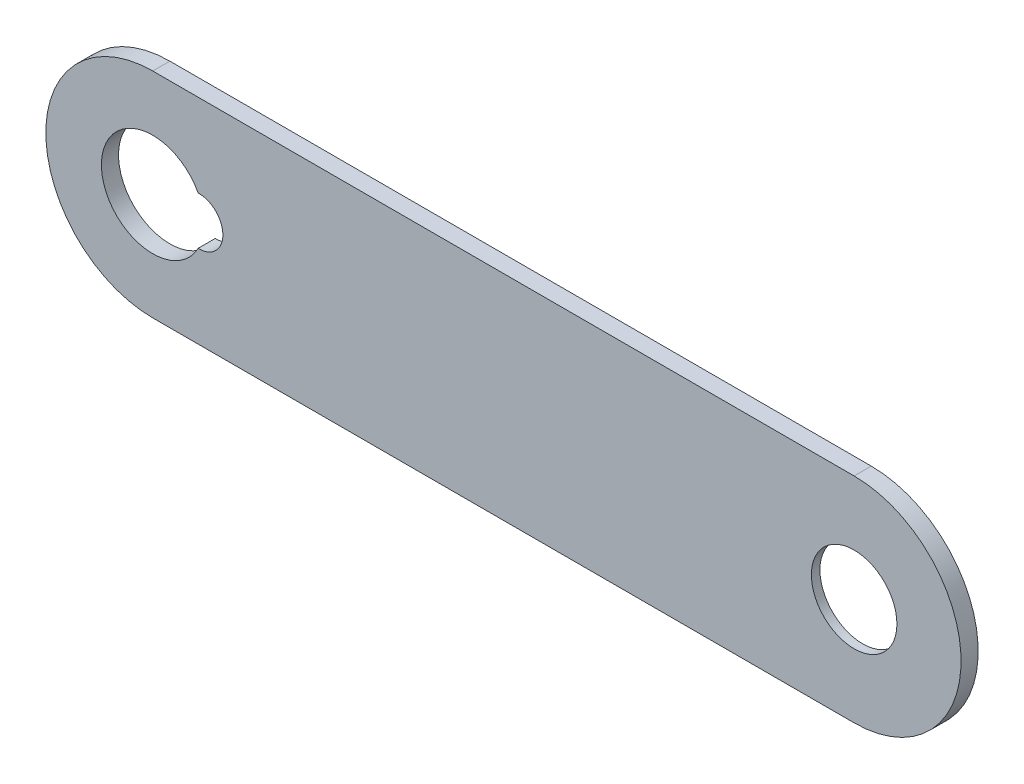
ISO-10303-21;
HEADER;
FILE_DESCRIPTION(('STEP AP214'),'2;1');
FILE_NAME('part.step','',(''),(''),'','','');
FILE_SCHEMA(('AUTOMOTIVE_DESIGN { 1 0 10303 214 1 1 1 1 }'));
ENDSEC;
DATA;
#1=APPLICATION_CONTEXT('core data for automotive mechanical design processes');
#2=APPLICATION_PROTOCOL_DEFINITION('international standard','automotive_design',2000,#1);
#3=PRODUCT_CONTEXT('',#1,'mechanical');
#4=PRODUCT('Part','Part','',(#3));
#5=PRODUCT_RELATED_PRODUCT_CATEGORY('part','',(#4));
#6=PRODUCT_DEFINITION_FORMATION('','',#4);
#7=PRODUCT_DEFINITION_CONTEXT('part definition',#1,'design');
#8=PRODUCT_DEFINITION('design','',#6,#7);
#9=PRODUCT_DEFINITION_SHAPE('','',#8);
#10=(LENGTH_UNIT() NAMED_UNIT(*) SI_UNIT(.MILLI.,.METRE.));
#11=(NAMED_UNIT(*) PLANE_ANGLE_UNIT() SI_UNIT($,.RADIAN.));
#12=(NAMED_UNIT(*) SI_UNIT($,.STERADIAN.) SOLID_ANGLE_UNIT());
#13=UNCERTAINTY_MEASURE_WITH_UNIT(LENGTH_MEASURE(1.E-05),#10,'distance_accuracy_value','');
#14=(GEOMETRIC_REPRESENTATION_CONTEXT(3) GLOBAL_UNCERTAINTY_ASSIGNED_CONTEXT((#13)) GLOBAL_UNIT_ASSIGNED_CONTEXT((#10,
#11,#12)) REPRESENTATION_CONTEXT('',''));
#15=CARTESIAN_POINT('',(0.,0.,0.));
#16=DIRECTION('',(0.,0.,1.));
#17=DIRECTION('',(1.,0.,0.));
#18=AXIS2_PLACEMENT_3D('',#15,#16,#17);
#19=CARTESIAN_POINT('',(32.5,8.60239852398525,2.));
#20=DIRECTION('',(0.,0.,1.));
#21=DIRECTION('',(1.,0.,0.));
#22=AXIS2_PLACEMENT_3D('',#19,#20,#21);
#23=PLANE('',#22);
#24=CARTESIAN_POINT('',(32.5,8.60239852398525,2.));
#25=DIRECTION('',(0.,0.,1.));
#26=DIRECTION('',(1.,0.,0.));
#27=AXIS2_PLACEMENT_3D('',#24,#25,#26);
#28=CIRCLE('',#27,5.);
#29=CARTESIAN_POINT('',(37.5,8.60239852398525,2.));
#30=VERTEX_POINT('',#29);
#31=EDGE_CURVE('E163',#30,#30,#28,.T.);
#32=ORIENTED_EDGE('',*,*,#31,.F.);
#33=EDGE_LOOP('',(#32));
#34=FACE_BOUND('',#33,.T.);
#35=CARTESIAN_POINT('',(-49.5,8.60239852398525,2.));
#36=DIRECTION('',(0.,0.,-1.));
#37=DIRECTION('',(-1.,0.,0.));
#38=AXIS2_PLACEMENT_3D('',#35,#36,#37);
#39=CIRCLE('',#38,6.);
#40=CARTESIAN_POINT('',(-44.1925925925926,5.80392990493715,2.));
#41=VERTEX_POINT('',#40);
#42=CARTESIAN_POINT('',(-44.1925925925926,11.4008671430333,2.));
#43=VERTEX_POINT('',#42);
#44=EDGE_CURVE('E78',#41,#43,#39,.T.);
#45=ORIENTED_EDGE('',*,*,#44,.T.);
#46=CARTESIAN_POINT('',(-44.1,8.60239852398525,2.));
#47=DIRECTION('',(0.,0.,-1.));
#48=DIRECTION('',(-1.,0.,0.));
#49=AXIS2_PLACEMENT_3D('',#46,#47,#48);
#50=CIRCLE('',#49,2.8);
#51=EDGE_CURVE('E211',#43,#41,#50,.T.);
#52=ORIENTED_EDGE('',*,*,#51,.T.);
#53=EDGE_LOOP('',(#45,#52));
#54=FACE_BOUND('',#53,.T.);
#55=CARTESIAN_POINT('',(32.5,8.60239852398525,2.));
#56=DIRECTION('',(0.,0.,1.));
#57=DIRECTION('',(1.,0.,0.));
#58=AXIS2_PLACEMENT_3D('',#55,#56,#57);
#59=CIRCLE('',#58,12.5);
#60=CARTESIAN_POINT('',(32.4999999999997,-3.89760147601474,2.));
#61=VERTEX_POINT('',#60);
#62=CARTESIAN_POINT('',(32.5,21.1023985239852,2.));
#63=VERTEX_POINT('',#62);
#64=EDGE_CURVE('E229',#61,#63,#59,.T.);
#65=ORIENTED_EDGE('',*,*,#64,.T.);
#66=DIRECTION('',(-1.,0.,0.));
#67=VECTOR('',#66,1.);
#68=CARTESIAN_POINT('',(-49.5,21.1023985239852,2.));
#69=LINE('',#68,#67);
#70=CARTESIAN_POINT('',(-49.5,21.1023985239852,2.));
#71=VERTEX_POINT('',#70);
#72=EDGE_CURVE('E232',#63,#71,#69,.T.);
#73=ORIENTED_EDGE('',*,*,#72,.T.);
#74=CARTESIAN_POINT('',(-49.5,8.60239852398525,2.));
#75=DIRECTION('',(0.,0.,1.));
#76=DIRECTION('',(-1.,0.,0.));
#77=AXIS2_PLACEMENT_3D('',#74,#75,#76);
#78=CIRCLE('',#77,12.5);
#79=CARTESIAN_POINT('',(-49.5,-3.89760147601474,2.));
#80=VERTEX_POINT('',#79);
#81=EDGE_CURVE('E236',#71,#80,#78,.T.);
#82=ORIENTED_EDGE('',*,*,#81,.T.);
#83=DIRECTION('',(1.,0.,0.));
#84=VECTOR('',#83,1.);
#85=CARTESIAN_POINT('',(32.4999999999997,-3.89760147601474,2.));
#86=LINE('',#85,#84);
#87=EDGE_CURVE('E178',#80,#61,#86,.T.);
#88=ORIENTED_EDGE('',*,*,#87,.T.);
#89=EDGE_LOOP('',(#65,#73,#82,#88));
#90=FACE_BOUND('',#89,.T.);
#91=ADVANCED_FACE('F52',(#34,#54,#90),#23,.T.);
#92=CARTESIAN_POINT('',(32.5,8.60239852398525,0.));
#93=DIRECTION('',(0.,0.,1.));
#94=DIRECTION('',(1.,0.,0.));
#95=AXIS2_PLACEMENT_3D('',#92,#93,#94);
#96=PLANE('',#95);
#97=DIRECTION('',(0.,1.,0.));
#98=VECTOR('',#97,1.);
#99=CARTESIAN_POINT('',(15.7,0.,0.));
#100=LINE('',#99,#98);
#101=CARTESIAN_POINT('',(15.7,2.40239852398525,0.));
#102=VERTEX_POINT('',#101);
#103=CARTESIAN_POINT('',(15.7,14.8023985239853,0.));
#104=VERTEX_POINT('',#103);
#105=EDGE_CURVE('E190',#102,#104,#100,.T.);
#106=ORIENTED_EDGE('',*,*,#105,.F.);
#107=DIRECTION('',(-1.,0.,0.));
#108=VECTOR('',#107,1.);
#109=CARTESIAN_POINT('',(0.,2.40239852398525,0.));
#110=LINE('',#109,#108);
#111=CARTESIAN_POINT('',(38.5,2.40239852398525,0.));
#112=VERTEX_POINT('',#111);
#113=EDGE_CURVE('E70',#112,#102,#110,.T.);
#114=ORIENTED_EDGE('',*,*,#113,.F.);
#115=DIRECTION('',(0.,-1.,0.));
#116=VECTOR('',#115,1.);
#117=CARTESIAN_POINT('',(38.5,0.,0.));
#118=LINE('',#117,#116);
#119=CARTESIAN_POINT('',(38.5,14.8023985239853,0.));
#120=VERTEX_POINT('',#119);
#121=EDGE_CURVE('E155',#120,#112,#118,.T.);
#122=ORIENTED_EDGE('',*,*,#121,.F.);
#123=DIRECTION('',(1.,0.,0.));
#124=VECTOR('',#123,1.);
#125=CARTESIAN_POINT('',(0.,14.8023985239853,0.));
#126=LINE('',#125,#124);
#127=EDGE_CURVE('E159',#104,#120,#126,.T.);
#128=ORIENTED_EDGE('',*,*,#127,.F.);
#129=EDGE_LOOP('',(#106,#114,#122,#128));
#130=FACE_BOUND('',#129,.T.);
#131=CARTESIAN_POINT('',(-44.1,8.60239852398525,0.));
#132=DIRECTION('',(0.,0.,-1.));
#133=DIRECTION('',(-1.,0.,0.));
#134=AXIS2_PLACEMENT_3D('',#131,#132,#133);
#135=CIRCLE('',#134,2.8);
#136=CARTESIAN_POINT('',(-44.1925925925926,11.4008671430333,0.));
#137=VERTEX_POINT('',#136);
#138=CARTESIAN_POINT('',(-44.1925925925926,5.80392990493715,0.));
#139=VERTEX_POINT('',#138);
#140=EDGE_CURVE('E212',#137,#139,#135,.T.);
#141=ORIENTED_EDGE('',*,*,#140,.F.);
#142=CARTESIAN_POINT('',(-49.5,8.60239852398525,0.));
#143=DIRECTION('',(0.,0.,-1.));
#144=DIRECTION('',(-1.,0.,0.));
#145=AXIS2_PLACEMENT_3D('',#142,#143,#144);
#146=CIRCLE('',#145,6.);
#147=EDGE_CURVE('E202',#139,#137,#146,.T.);
#148=ORIENTED_EDGE('',*,*,#147,.F.);
#149=EDGE_LOOP('',(#141,#148));
#150=FACE_BOUND('',#149,.T.);
#151=CARTESIAN_POINT('',(32.5,8.60239852398525,0.));
#152=DIRECTION('',(0.,0.,1.));
#153=DIRECTION('',(1.,0.,0.));
#154=AXIS2_PLACEMENT_3D('',#151,#152,#153);
#155=CIRCLE('',#154,12.5);
#156=CARTESIAN_POINT('',(32.4999999999997,-3.89760147601474,0.));
#157=VERTEX_POINT('',#156);
#158=CARTESIAN_POINT('',(32.5,21.1023985239852,0.));
#159=VERTEX_POINT('',#158);
#160=EDGE_CURVE('E170',#157,#159,#155,.T.);
#161=ORIENTED_EDGE('',*,*,#160,.F.);
#162=DIRECTION('',(1.,0.,0.));
#163=VECTOR('',#162,1.);
#164=CARTESIAN_POINT('',(32.4999999999997,-3.89760147601474,0.));
#165=LINE('',#164,#163);
#166=CARTESIAN_POINT('',(-49.5,-3.89760147601474,0.));
#167=VERTEX_POINT('',#166);
#168=EDGE_CURVE('E233',#167,#157,#165,.T.);
#169=ORIENTED_EDGE('',*,*,#168,.F.);
#170=CARTESIAN_POINT('',(-49.5,8.60239852398525,0.));
#171=DIRECTION('',(0.,0.,1.));
#172=DIRECTION('',(-1.,0.,0.));
#173=AXIS2_PLACEMENT_3D('',#170,#171,#172);
#174=CIRCLE('',#173,12.5);
#175=CARTESIAN_POINT('',(-49.5,21.1023985239852,0.));
#176=VERTEX_POINT('',#175);
#177=EDGE_CURVE('E183',#176,#167,#174,.T.);
#178=ORIENTED_EDGE('',*,*,#177,.F.);
#179=DIRECTION('',(-1.,0.,0.));
#180=VECTOR('',#179,1.);
#181=CARTESIAN_POINT('',(-49.5,21.1023985239852,0.));
#182=LINE('',#181,#180);
#183=EDGE_CURVE('E176',#159,#176,#182,.T.);
#184=ORIENTED_EDGE('',*,*,#183,.F.);
#185=EDGE_LOOP('',(#161,#169,#178,#184));
#186=FACE_BOUND('',#185,.T.);
#187=ADVANCED_FACE('F266',(#130,#150,#186),#96,.F.);
#188=CARTESIAN_POINT('',(32.5,8.60239852398525,2.));
#189=DIRECTION('',(0.,0.,-1.));
#190=DIRECTION('',(-1.,0.,0.));
#191=AXIS2_PLACEMENT_3D('',#188,#189,#190);
#192=CYLINDRICAL_SURFACE('',#191,12.5);
#193=ORIENTED_EDGE('',*,*,#160,.T.);
#194=DIRECTION('',(0.,0.,-1.));
#195=VECTOR('',#194,1.);
#196=CARTESIAN_POINT('',(32.5,21.1023985239852,2.));
#197=LINE('',#196,#195);
#198=EDGE_CURVE('E12',#63,#159,#197,.T.);
#199=ORIENTED_EDGE('',*,*,#198,.F.);
#200=ORIENTED_EDGE('',*,*,#64,.F.);
#201=DIRECTION('',(0.,0.,-1.));
#202=VECTOR('',#201,1.);
#203=CARTESIAN_POINT('',(32.4999999999997,-3.89760147601474,2.));
#204=LINE('',#203,#202);
#205=EDGE_CURVE('E242',#61,#157,#204,.T.);
#206=ORIENTED_EDGE('',*,*,#205,.T.);
#207=EDGE_LOOP('',(#193,#199,#200,#206));
#208=FACE_BOUND('',#207,.T.);
#209=ADVANCED_FACE('F54',(#208),#192,.T.);
#210=CARTESIAN_POINT('',(-49.5,21.1023985239852,2.));
#211=DIRECTION('',(0.,-1.,0.));
#212=DIRECTION('',(0.,0.,-1.));
#213=AXIS2_PLACEMENT_3D('',#210,#211,#212);
#214=PLANE('',#213);
#215=ORIENTED_EDGE('',*,*,#183,.T.);
#216=DIRECTION('',(0.,0.,-1.));
#217=VECTOR('',#216,1.);
#218=CARTESIAN_POINT('',(-49.5,21.1023985239852,2.));
#219=LINE('',#218,#217);
#220=EDGE_CURVE('E63',#71,#176,#219,.T.);
#221=ORIENTED_EDGE('',*,*,#220,.F.);
#222=ORIENTED_EDGE('',*,*,#72,.F.);
#223=ORIENTED_EDGE('',*,*,#198,.T.);
#224=EDGE_LOOP('',(#215,#221,#222,#223));
#225=FACE_BOUND('',#224,.T.);
#226=ADVANCED_FACE('F272',(#225),#214,.F.);
#227=CARTESIAN_POINT('',(-49.5,8.60239852398525,2.));
#228=DIRECTION('',(0.,0.,-1.));
#229=DIRECTION('',(-1.,0.,0.));
#230=AXIS2_PLACEMENT_3D('',#227,#228,#229);
#231=CYLINDRICAL_SURFACE('',#230,12.5);
#232=ORIENTED_EDGE('',*,*,#177,.T.);
#233=DIRECTION('',(0.,0.,-1.));
#234=VECTOR('',#233,1.);
#235=CARTESIAN_POINT('',(-49.5,-3.89760147601474,2.));
#236=LINE('',#235,#234);
#237=EDGE_CURVE('E247',#80,#167,#236,.T.);
#238=ORIENTED_EDGE('',*,*,#237,.F.);
#239=ORIENTED_EDGE('',*,*,#81,.F.);
#240=ORIENTED_EDGE('',*,*,#220,.T.);
#241=EDGE_LOOP('',(#232,#238,#239,#240));
#242=FACE_BOUND('',#241,.T.);
#243=ADVANCED_FACE('F262',(#242),#231,.T.);
#244=CARTESIAN_POINT('',(32.4999999999997,-3.89760147601474,2.));
#245=DIRECTION('',(0.,1.,0.));
#246=DIRECTION('',(0.,0.,1.));
#247=AXIS2_PLACEMENT_3D('',#244,#245,#246);
#248=PLANE('',#247);
#249=ORIENTED_EDGE('',*,*,#168,.T.);
#250=ORIENTED_EDGE('',*,*,#205,.F.);
#251=ORIENTED_EDGE('',*,*,#87,.F.);
#252=ORIENTED_EDGE('',*,*,#237,.T.);
#253=EDGE_LOOP('',(#249,#250,#251,#252));
#254=FACE_BOUND('',#253,.T.);
#255=ADVANCED_FACE('F270',(#254),#248,.F.);
#256=CARTESIAN_POINT('',(-49.5,8.60239852398525,2.));
#257=DIRECTION('',(0.,0.,-1.));
#258=DIRECTION('',(-1.,0.,0.));
#259=AXIS2_PLACEMENT_3D('',#256,#257,#258);
#260=CYLINDRICAL_SURFACE('',#259,6.);
#261=ORIENTED_EDGE('',*,*,#147,.T.);
#262=DIRECTION('',(0.,0.,-1.));
#263=VECTOR('',#262,1.);
#264=CARTESIAN_POINT('',(-44.1925925925926,11.4008671430333,2.));
#265=LINE('',#264,#263);
#266=EDGE_CURVE('E224',#43,#137,#265,.T.);
#267=ORIENTED_EDGE('',*,*,#266,.F.);
#268=ORIENTED_EDGE('',*,*,#44,.F.);
#269=DIRECTION('',(0.,0.,-1.));
#270=VECTOR('',#269,1.);
#271=CARTESIAN_POINT('',(-44.1925925925926,5.80392990493715,2.));
#272=LINE('',#271,#270);
#273=EDGE_CURVE('E177',#41,#139,#272,.T.);
#274=ORIENTED_EDGE('',*,*,#273,.T.);
#275=EDGE_LOOP('',(#261,#267,#268,#274));
#276=FACE_BOUND('',#275,.T.);
#277=ADVANCED_FACE('F290',(#276),#260,.F.);
#278=CARTESIAN_POINT('',(-44.1,8.60239852398525,2.));
#279=DIRECTION('',(0.,0.,-1.));
#280=DIRECTION('',(-1.,0.,0.));
#281=AXIS2_PLACEMENT_3D('',#278,#279,#280);
#282=CYLINDRICAL_SURFACE('',#281,2.8);
#283=ORIENTED_EDGE('',*,*,#140,.T.);
#284=ORIENTED_EDGE('',*,*,#273,.F.);
#285=ORIENTED_EDGE('',*,*,#51,.F.);
#286=ORIENTED_EDGE('',*,*,#266,.T.);
#287=EDGE_LOOP('',(#283,#284,#285,#286));
#288=FACE_BOUND('',#287,.T.);
#289=ADVANCED_FACE('F297',(#288),#282,.F.);
#290=CARTESIAN_POINT('',(0.,2.40239852398525,1.));
#291=DIRECTION('',(0.,-1.,0.));
#292=DIRECTION('',(0.,0.,-1.));
#293=AXIS2_PLACEMENT_3D('',#290,#291,#292);
#294=PLANE('',#293);
#295=ORIENTED_EDGE('',*,*,#113,.T.);
#296=DIRECTION('',(0.,0.,-1.));
#297=VECTOR('',#296,1.);
#298=CARTESIAN_POINT('',(15.7,2.40239852398525,1.));
#299=LINE('',#298,#297);
#300=CARTESIAN_POINT('',(15.7,2.40239852398525,1.));
#301=VERTEX_POINT('',#300);
#302=EDGE_CURVE('E130',#301,#102,#299,.T.);
#303=ORIENTED_EDGE('',*,*,#302,.F.);
#304=DIRECTION('',(-1.,0.,0.));
#305=VECTOR('',#304,1.);
#306=CARTESIAN_POINT('',(0.,2.40239852398525,1.));
#307=LINE('',#306,#305);
#308=CARTESIAN_POINT('',(38.5,2.40239852398525,1.));
#309=VERTEX_POINT('',#308);
#310=EDGE_CURVE('E134',#309,#301,#307,.T.);
#311=ORIENTED_EDGE('',*,*,#310,.F.);
#312=DIRECTION('',(0.,0.,-1.));
#313=VECTOR('',#312,1.);
#314=CARTESIAN_POINT('',(38.5,2.40239852398525,1.));
#315=LINE('',#314,#313);
#316=EDGE_CURVE('E199',#309,#112,#315,.T.);
#317=ORIENTED_EDGE('',*,*,#316,.T.);
#318=EDGE_LOOP('',(#295,#303,#311,#317));
#319=FACE_BOUND('',#318,.T.);
#320=ADVANCED_FACE('F132',(#319),#294,.F.);
#321=CARTESIAN_POINT('',(38.5,0.,1.));
#322=DIRECTION('',(1.,0.,0.));
#323=DIRECTION('',(0.,0.,-1.));
#324=AXIS2_PLACEMENT_3D('',#321,#322,#323);
#325=PLANE('',#324);
#326=ORIENTED_EDGE('',*,*,#121,.T.);
#327=ORIENTED_EDGE('',*,*,#316,.F.);
#328=DIRECTION('',(0.,-1.,0.));
#329=VECTOR('',#328,1.);
#330=CARTESIAN_POINT('',(38.5,0.,1.));
#331=LINE('',#330,#329);
#332=CARTESIAN_POINT('',(38.5,14.8023985239853,1.));
#333=VERTEX_POINT('',#332);
#334=EDGE_CURVE('E141',#333,#309,#331,.T.);
#335=ORIENTED_EDGE('',*,*,#334,.F.);
#336=DIRECTION('',(0.,0.,-1.));
#337=VECTOR('',#336,1.);
#338=CARTESIAN_POINT('',(38.5,14.8023985239853,1.));
#339=LINE('',#338,#337);
#340=EDGE_CURVE('E203',#333,#120,#339,.T.);
#341=ORIENTED_EDGE('',*,*,#340,.T.);
#342=EDGE_LOOP('',(#326,#327,#335,#341));
#343=FACE_BOUND('',#342,.T.);
#344=ADVANCED_FACE('F315',(#343),#325,.F.);
#345=CARTESIAN_POINT('',(0.,14.8023985239853,1.));
#346=DIRECTION('',(0.,1.,0.));
#347=DIRECTION('',(0.,0.,1.));
#348=AXIS2_PLACEMENT_3D('',#345,#346,#347);
#349=PLANE('',#348);
#350=ORIENTED_EDGE('',*,*,#127,.T.);
#351=ORIENTED_EDGE('',*,*,#340,.F.);
#352=DIRECTION('',(1.,0.,0.));
#353=VECTOR('',#352,1.);
#354=CARTESIAN_POINT('',(0.,14.8023985239853,1.));
#355=LINE('',#354,#353);
#356=CARTESIAN_POINT('',(15.7,14.8023985239853,1.));
#357=VERTEX_POINT('',#356);
#358=EDGE_CURVE('E150',#357,#333,#355,.T.);
#359=ORIENTED_EDGE('',*,*,#358,.F.);
#360=DIRECTION('',(0.,0.,-1.));
#361=VECTOR('',#360,1.);
#362=CARTESIAN_POINT('',(15.7,14.8023985239853,1.));
#363=LINE('',#362,#361);
#364=EDGE_CURVE('E140',#357,#104,#363,.T.);
#365=ORIENTED_EDGE('',*,*,#364,.T.);
#366=EDGE_LOOP('',(#350,#351,#359,#365));
#367=FACE_BOUND('',#366,.T.);
#368=ADVANCED_FACE('F337',(#367),#349,.F.);
#369=CARTESIAN_POINT('',(15.7,0.,1.));
#370=DIRECTION('',(-1.,0.,0.));
#371=DIRECTION('',(0.,0.,1.));
#372=AXIS2_PLACEMENT_3D('',#369,#370,#371);
#373=PLANE('',#372);
#374=ORIENTED_EDGE('',*,*,#105,.T.);
#375=ORIENTED_EDGE('',*,*,#364,.F.);
#376=DIRECTION('',(0.,1.,0.));
#377=VECTOR('',#376,1.);
#378=CARTESIAN_POINT('',(15.7,0.,1.));
#379=LINE('',#378,#377);
#380=EDGE_CURVE('E144',#301,#357,#379,.T.);
#381=ORIENTED_EDGE('',*,*,#380,.F.);
#382=ORIENTED_EDGE('',*,*,#302,.T.);
#383=EDGE_LOOP('',(#374,#375,#381,#382));
#384=FACE_BOUND('',#383,.T.);
#385=ADVANCED_FACE('F145',(#384),#373,.F.);
#386=CARTESIAN_POINT('',(0.,0.,1.));
#387=DIRECTION('',(0.,0.,-1.));
#388=DIRECTION('',(-1.,0.,0.));
#389=AXIS2_PLACEMENT_3D('',#386,#387,#388);
#390=PLANE('',#389);
#391=CARTESIAN_POINT('',(32.5,8.60239852398525,1.));
#392=DIRECTION('',(0.,0.,-1.));
#393=DIRECTION('',(-1.,0.,0.));
#394=AXIS2_PLACEMENT_3D('',#391,#392,#393);
#395=CIRCLE('',#394,5.);
#396=CARTESIAN_POINT('',(27.5,8.60239852398525,1.));
#397=VERTEX_POINT('',#396);
#398=EDGE_CURVE('E56',#397,#397,#395,.T.);
#399=ORIENTED_EDGE('',*,*,#398,.F.);
#400=EDGE_LOOP('',(#399));
#401=FACE_BOUND('',#400,.T.);
#402=ORIENTED_EDGE('',*,*,#310,.T.);
#403=ORIENTED_EDGE('',*,*,#380,.T.);
#404=ORIENTED_EDGE('',*,*,#358,.T.);
#405=ORIENTED_EDGE('',*,*,#334,.T.);
#406=EDGE_LOOP('',(#402,#403,#404,#405));
#407=FACE_BOUND('',#406,.T.);
#408=ADVANCED_FACE('F152',(#401,#407),#390,.T.);
#409=CARTESIAN_POINT('',(32.5,8.60239852398525,-8.));
#410=DIRECTION('',(0.,0.,1.));
#411=DIRECTION('',(1.,0.,0.));
#412=AXIS2_PLACEMENT_3D('',#409,#410,#411);
#413=CYLINDRICAL_SURFACE('',#412,5.);
#414=ORIENTED_EDGE('',*,*,#398,.T.);
#415=EDGE_LOOP('',(#414));
#416=FACE_BOUND('',#415,.T.);
#417=ORIENTED_EDGE('',*,*,#31,.T.);
#418=EDGE_LOOP('',(#417));
#419=FACE_BOUND('',#418,.T.);
#420=ADVANCED_FACE('F326',(#416,#419),#413,.F.);
#421=CLOSED_SHELL('',(#91,#187,#209,#226,#243,#255,#277,#289,#320,#344,#368,#385,#408,#420));
#422=MANIFOLD_SOLID_BREP('B2',#421);
#423=ADVANCED_BREP_SHAPE_REPRESENTATION('',(#18,#422),#14);
#424=SHAPE_DEFINITION_REPRESENTATION(#9,#423);
ENDSEC;
END-ISO-10303-21;
